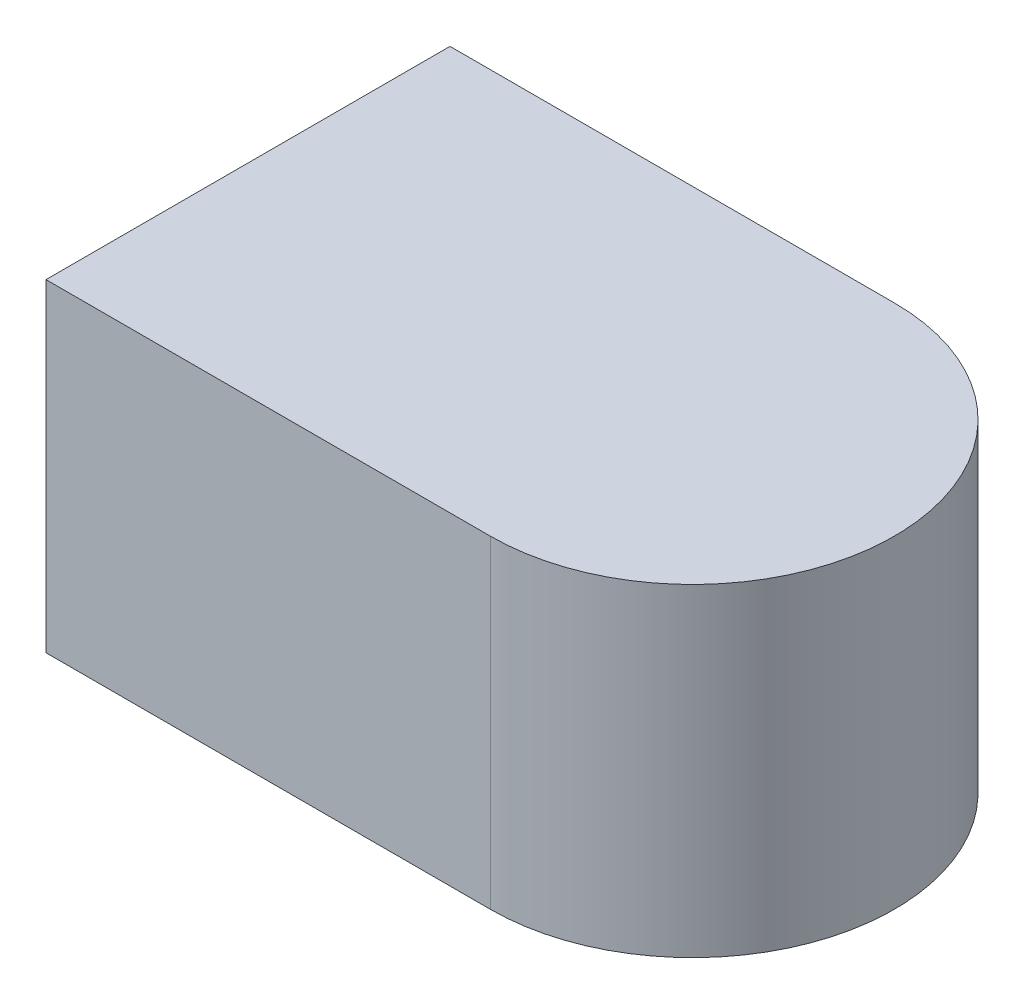
ISO-10303-21;
HEADER;
FILE_DESCRIPTION(('STEP AP214'),'2;1');
FILE_NAME('part.step','',(''),(''),'','','');
FILE_SCHEMA(('AUTOMOTIVE_DESIGN { 1 0 10303 214 1 1 1 1 }'));
ENDSEC;
DATA;
#1=APPLICATION_CONTEXT('core data for automotive mechanical design processes');
#2=APPLICATION_PROTOCOL_DEFINITION('international standard','automotive_design',2000,#1);
#3=PRODUCT_CONTEXT('',#1,'mechanical');
#4=PRODUCT('Part','Part','',(#3));
#5=PRODUCT_RELATED_PRODUCT_CATEGORY('part','',(#4));
#6=PRODUCT_DEFINITION_FORMATION('','',#4);
#7=PRODUCT_DEFINITION_CONTEXT('part definition',#1,'design');
#8=PRODUCT_DEFINITION('design','',#6,#7);
#9=PRODUCT_DEFINITION_SHAPE('','',#8);
#10=(LENGTH_UNIT() NAMED_UNIT(*) SI_UNIT(.MILLI.,.METRE.));
#11=(NAMED_UNIT(*) PLANE_ANGLE_UNIT() SI_UNIT($,.RADIAN.));
#12=(NAMED_UNIT(*) SI_UNIT($,.STERADIAN.) SOLID_ANGLE_UNIT());
#13=UNCERTAINTY_MEASURE_WITH_UNIT(LENGTH_MEASURE(1.E-05),#10,'distance_accuracy_value','');
#14=(GEOMETRIC_REPRESENTATION_CONTEXT(3) GLOBAL_UNCERTAINTY_ASSIGNED_CONTEXT((#13)) GLOBAL_UNIT_ASSIGNED_CONTEXT((#10,
#11,#12)) REPRESENTATION_CONTEXT('',''));
#15=CARTESIAN_POINT('',(0.,0.,0.));
#16=DIRECTION('',(0.,0.,1.));
#17=DIRECTION('',(1.,0.,0.));
#18=AXIS2_PLACEMENT_3D('',#15,#16,#17);
#19=CARTESIAN_POINT('',(0.,0.,0.));
#20=DIRECTION('',(0.,-1.,0.));
#21=DIRECTION('',(-1.,0.,0.));
#22=AXIS2_PLACEMENT_3D('',#19,#20,#21);
#23=PLANE('',#22);
#24=CARTESIAN_POINT('',(-1.225,0.,0.25));
#25=DIRECTION('',(0.,-1.,0.));
#26=DIRECTION('',(0.,0.,-1.));
#27=AXIS2_PLACEMENT_3D('',#24,#25,#26);
#28=CIRCLE('',#27,0.125);
#29=CARTESIAN_POINT('',(-1.225,0.,0.125));
#30=VERTEX_POINT('',#29);
#31=CARTESIAN_POINT('',(-1.225,0.,0.375));
#32=VERTEX_POINT('',#31);
#33=EDGE_CURVE('E11',#30,#32,#28,.T.);
#34=ORIENTED_EDGE('',*,*,#33,.T.);
#35=DIRECTION('',(-1.,0.,0.));
#36=VECTOR('',#35,1.);
#37=CARTESIAN_POINT('',(-1.225,0.,0.375));
#38=LINE('',#37,#36);
#39=CARTESIAN_POINT('',(-1.5,0.,0.375));
#40=VERTEX_POINT('',#39);
#41=EDGE_CURVE('E24',#32,#40,#38,.T.);
#42=ORIENTED_EDGE('',*,*,#41,.T.);
#43=DIRECTION('',(0.,0.,-1.));
#44=VECTOR('',#43,1.);
#45=CARTESIAN_POINT('',(-1.5,0.,0.375));
#46=LINE('',#45,#44);
#47=CARTESIAN_POINT('',(-1.5,0.,0.125));
#48=VERTEX_POINT('',#47);
#49=EDGE_CURVE('E62',#40,#48,#46,.T.);
#50=ORIENTED_EDGE('',*,*,#49,.T.);
#51=DIRECTION('',(1.,0.,0.));
#52=VECTOR('',#51,1.);
#53=CARTESIAN_POINT('',(-1.5,0.,0.125));
#54=LINE('',#53,#52);
#55=EDGE_CURVE('E36',#48,#30,#54,.T.);
#56=ORIENTED_EDGE('',*,*,#55,.T.);
#57=EDGE_LOOP('',(#34,#42,#50,#56));
#58=FACE_BOUND('',#57,.T.);
#59=ADVANCED_FACE('F17',(#58),#23,.T.);
#60=CARTESIAN_POINT('',(-1.5,0.,0.125));
#61=DIRECTION('',(0.,0.,1.));
#62=DIRECTION('',(1.,0.,0.));
#63=AXIS2_PLACEMENT_3D('',#60,#61,#62);
#64=PLANE('',#63);
#65=DIRECTION('',(0.,1.,0.));
#66=VECTOR('',#65,1.);
#67=CARTESIAN_POINT('',(-1.5,0.,0.125));
#68=LINE('',#67,#66);
#69=CARTESIAN_POINT('',(-1.5,0.2,0.125));
#70=VERTEX_POINT('',#69);
#71=EDGE_CURVE('E84',#48,#70,#68,.T.);
#72=ORIENTED_EDGE('',*,*,#71,.T.);
#73=DIRECTION('',(1.,0.,0.));
#74=VECTOR('',#73,1.);
#75=CARTESIAN_POINT('',(-1.5,0.2,0.125));
#76=LINE('',#75,#74);
#77=CARTESIAN_POINT('',(-1.225,0.2,0.125));
#78=VERTEX_POINT('',#77);
#79=EDGE_CURVE('E74',#70,#78,#76,.T.);
#80=ORIENTED_EDGE('',*,*,#79,.T.);
#81=DIRECTION('',(0.,1.,0.));
#82=VECTOR('',#81,1.);
#83=CARTESIAN_POINT('',(-1.225,0.,0.125));
#84=LINE('',#83,#82);
#85=EDGE_CURVE('E81',#30,#78,#84,.T.);
#86=ORIENTED_EDGE('',*,*,#85,.F.);
#87=ORIENTED_EDGE('',*,*,#55,.F.);
#88=EDGE_LOOP('',(#72,#80,#86,#87));
#89=FACE_BOUND('',#88,.T.);
#90=ADVANCED_FACE('F91',(#89),#64,.F.);
#91=CARTESIAN_POINT('',(-1.225,0.,0.25));
#92=DIRECTION('',(0.,-1.,0.));
#93=DIRECTION('',(-1.,0.,0.));
#94=AXIS2_PLACEMENT_3D('',#91,#92,#93);
#95=CYLINDRICAL_SURFACE('',#94,0.125);
#96=ORIENTED_EDGE('',*,*,#85,.T.);
#97=CARTESIAN_POINT('',(-1.225,0.2,0.25));
#98=DIRECTION('',(0.,-1.,0.));
#99=DIRECTION('',(0.,0.,-1.));
#100=AXIS2_PLACEMENT_3D('',#97,#98,#99);
#101=CIRCLE('',#100,0.125);
#102=CARTESIAN_POINT('',(-1.225,0.2,0.375));
#103=VERTEX_POINT('',#102);
#104=EDGE_CURVE('E79',#78,#103,#101,.T.);
#105=ORIENTED_EDGE('',*,*,#104,.T.);
#106=DIRECTION('',(0.,1.,0.));
#107=VECTOR('',#106,1.);
#108=CARTESIAN_POINT('',(-1.225,0.,0.375));
#109=LINE('',#108,#107);
#110=EDGE_CURVE('E68',#32,#103,#109,.T.);
#111=ORIENTED_EDGE('',*,*,#110,.F.);
#112=ORIENTED_EDGE('',*,*,#33,.F.);
#113=EDGE_LOOP('',(#96,#105,#111,#112));
#114=FACE_BOUND('',#113,.T.);
#115=ADVANCED_FACE('F89',(#114),#95,.T.);
#116=CARTESIAN_POINT('',(-1.225,0.,0.375));
#117=DIRECTION('',(0.,0.,-1.));
#118=DIRECTION('',(-1.,0.,0.));
#119=AXIS2_PLACEMENT_3D('',#116,#117,#118);
#120=PLANE('',#119);
#121=ORIENTED_EDGE('',*,*,#110,.T.);
#122=DIRECTION('',(-1.,0.,0.));
#123=VECTOR('',#122,1.);
#124=CARTESIAN_POINT('',(-1.225,0.2,0.375));
#125=LINE('',#124,#123);
#126=CARTESIAN_POINT('',(-1.5,0.2,0.375));
#127=VERTEX_POINT('',#126);
#128=EDGE_CURVE('E63',#103,#127,#125,.T.);
#129=ORIENTED_EDGE('',*,*,#128,.T.);
#130=DIRECTION('',(0.,1.,0.));
#131=VECTOR('',#130,1.);
#132=CARTESIAN_POINT('',(-1.5,0.,0.375));
#133=LINE('',#132,#131);
#134=EDGE_CURVE('E56',#40,#127,#133,.T.);
#135=ORIENTED_EDGE('',*,*,#134,.F.);
#136=ORIENTED_EDGE('',*,*,#41,.F.);
#137=EDGE_LOOP('',(#121,#129,#135,#136));
#138=FACE_BOUND('',#137,.T.);
#139=ADVANCED_FACE('F66',(#138),#120,.F.);
#140=CARTESIAN_POINT('',(-1.5,0.,0.375));
#141=DIRECTION('',(1.,0.,0.));
#142=DIRECTION('',(0.,0.,-1.));
#143=AXIS2_PLACEMENT_3D('',#140,#141,#142);
#144=PLANE('',#143);
#145=ORIENTED_EDGE('',*,*,#134,.T.);
#146=DIRECTION('',(0.,0.,-1.));
#147=VECTOR('',#146,1.);
#148=CARTESIAN_POINT('',(-1.5,0.2,0.375));
#149=LINE('',#148,#147);
#150=EDGE_CURVE('E61',#127,#70,#149,.T.);
#151=ORIENTED_EDGE('',*,*,#150,.T.);
#152=ORIENTED_EDGE('',*,*,#71,.F.);
#153=ORIENTED_EDGE('',*,*,#49,.F.);
#154=EDGE_LOOP('',(#145,#151,#152,#153));
#155=FACE_BOUND('',#154,.T.);
#156=ADVANCED_FACE('F58',(#155),#144,.F.);
#157=CARTESIAN_POINT('',(0.,0.2,0.));
#158=DIRECTION('',(0.,-1.,0.));
#159=DIRECTION('',(-1.,0.,0.));
#160=AXIS2_PLACEMENT_3D('',#157,#158,#159);
#161=PLANE('',#160);
#162=ORIENTED_EDGE('',*,*,#150,.F.);
#163=ORIENTED_EDGE('',*,*,#128,.F.);
#164=ORIENTED_EDGE('',*,*,#104,.F.);
#165=ORIENTED_EDGE('',*,*,#79,.F.);
#166=EDGE_LOOP('',(#162,#163,#164,#165));
#167=FACE_BOUND('',#166,.T.);
#168=ADVANCED_FACE('F72',(#167),#161,.F.);
#169=CLOSED_SHELL('',(#59,#90,#115,#139,#156,#168));
#170=MANIFOLD_SOLID_BREP('B1',#169);
#171=ADVANCED_BREP_SHAPE_REPRESENTATION('',(#18,#170),#14);
#172=SHAPE_DEFINITION_REPRESENTATION(#9,#171);
ENDSEC;
END-ISO-10303-21;
